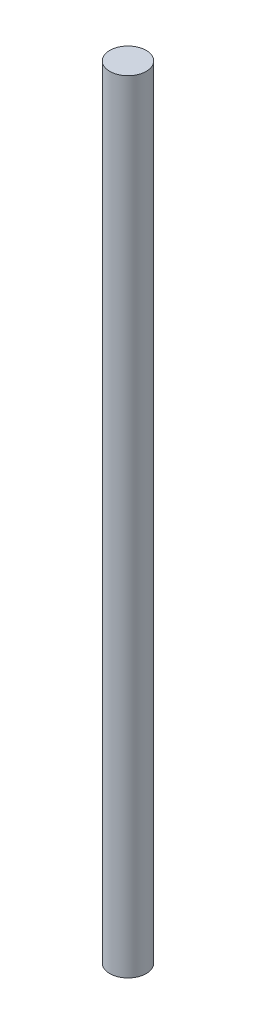
ISO-10303-21;
HEADER;
FILE_DESCRIPTION(('STEP AP214'),'2;1');
FILE_NAME('part.step','',(''),(''),'','','');
FILE_SCHEMA(('AUTOMOTIVE_DESIGN { 1 0 10303 214 1 1 1 1 }'));
ENDSEC;
DATA;
#1=APPLICATION_CONTEXT('core data for automotive mechanical design processes');
#2=APPLICATION_PROTOCOL_DEFINITION('international standard','automotive_design',2000,#1);
#3=PRODUCT_CONTEXT('',#1,'mechanical');
#4=PRODUCT('Part','Part','',(#3));
#5=PRODUCT_RELATED_PRODUCT_CATEGORY('part','',(#4));
#6=PRODUCT_DEFINITION_FORMATION('','',#4);
#7=PRODUCT_DEFINITION_CONTEXT('part definition',#1,'design');
#8=PRODUCT_DEFINITION('design','',#6,#7);
#9=PRODUCT_DEFINITION_SHAPE('','',#8);
#10=(LENGTH_UNIT() NAMED_UNIT(*) SI_UNIT(.MILLI.,.METRE.));
#11=(NAMED_UNIT(*) PLANE_ANGLE_UNIT() SI_UNIT($,.RADIAN.));
#12=(NAMED_UNIT(*) SI_UNIT($,.STERADIAN.) SOLID_ANGLE_UNIT());
#13=UNCERTAINTY_MEASURE_WITH_UNIT(LENGTH_MEASURE(1.E-05),#10,'distance_accuracy_value','');
#14=(GEOMETRIC_REPRESENTATION_CONTEXT(3) GLOBAL_UNCERTAINTY_ASSIGNED_CONTEXT((#13)) GLOBAL_UNIT_ASSIGNED_CONTEXT((#10,
#11,#12)) REPRESENTATION_CONTEXT('',''));
#15=CARTESIAN_POINT('',(0.,0.,0.));
#16=DIRECTION('',(0.,0.,1.));
#17=DIRECTION('',(1.,0.,0.));
#18=AXIS2_PLACEMENT_3D('',#15,#16,#17);
#19=CARTESIAN_POINT('',(0.,101.6,0.));
#20=DIRECTION('',(0.,-1.,0.));
#21=DIRECTION('',(0.,0.,-1.));
#22=AXIS2_PLACEMENT_3D('',#19,#20,#21);
#23=CYLINDRICAL_SURFACE('',#22,2.36855);
#24=CARTESIAN_POINT('',(0.,101.6,0.));
#25=DIRECTION('',(0.,1.,0.));
#26=DIRECTION('',(0.,0.,1.));
#27=AXIS2_PLACEMENT_3D('',#24,#25,#26);
#28=CIRCLE('',#27,2.36855);
#29=CARTESIAN_POINT('',(0.,101.6,2.36855));
#30=VERTEX_POINT('',#29);
#31=EDGE_CURVE('E10',#30,#30,#28,.T.);
#32=ORIENTED_EDGE('',*,*,#31,.F.);
#33=EDGE_LOOP('',(#32));
#34=FACE_BOUND('',#33,.T.);
#35=CARTESIAN_POINT('',(0.,0.,0.));
#36=DIRECTION('',(0.,1.,0.));
#37=DIRECTION('',(0.,0.,1.));
#38=AXIS2_PLACEMENT_3D('',#35,#36,#37);
#39=CIRCLE('',#38,2.36855);
#40=CARTESIAN_POINT('',(0.,0.,2.36855));
#41=VERTEX_POINT('',#40);
#42=EDGE_CURVE('E34',#41,#41,#39,.T.);
#43=ORIENTED_EDGE('',*,*,#42,.T.);
#44=EDGE_LOOP('',(#43));
#45=FACE_BOUND('',#44,.T.);
#46=ADVANCED_FACE('F31',(#34,#45),#23,.T.);
#47=CARTESIAN_POINT('',(0.,101.6,0.));
#48=DIRECTION('',(0.,1.,0.));
#49=DIRECTION('',(0.,0.,1.));
#50=AXIS2_PLACEMENT_3D('',#47,#48,#49);
#51=PLANE('',#50);
#52=ORIENTED_EDGE('',*,*,#31,.T.);
#53=EDGE_LOOP('',(#52));
#54=FACE_BOUND('',#53,.T.);
#55=ADVANCED_FACE('F46',(#54),#51,.T.);
#56=CARTESIAN_POINT('',(0.,0.,0.));
#57=DIRECTION('',(0.,1.,0.));
#58=DIRECTION('',(0.,0.,1.));
#59=AXIS2_PLACEMENT_3D('',#56,#57,#58);
#60=PLANE('',#59);
#61=ORIENTED_EDGE('',*,*,#42,.F.);
#62=EDGE_LOOP('',(#61));
#63=FACE_BOUND('',#62,.T.);
#64=ADVANCED_FACE('F44',(#63),#60,.F.);
#65=CLOSED_SHELL('',(#46,#55,#64));
#66=MANIFOLD_SOLID_BREP('B2',#65);
#67=ADVANCED_BREP_SHAPE_REPRESENTATION('',(#18,#66),#14);
#68=SHAPE_DEFINITION_REPRESENTATION(#9,#67);
ENDSEC;
END-ISO-10303-21;
